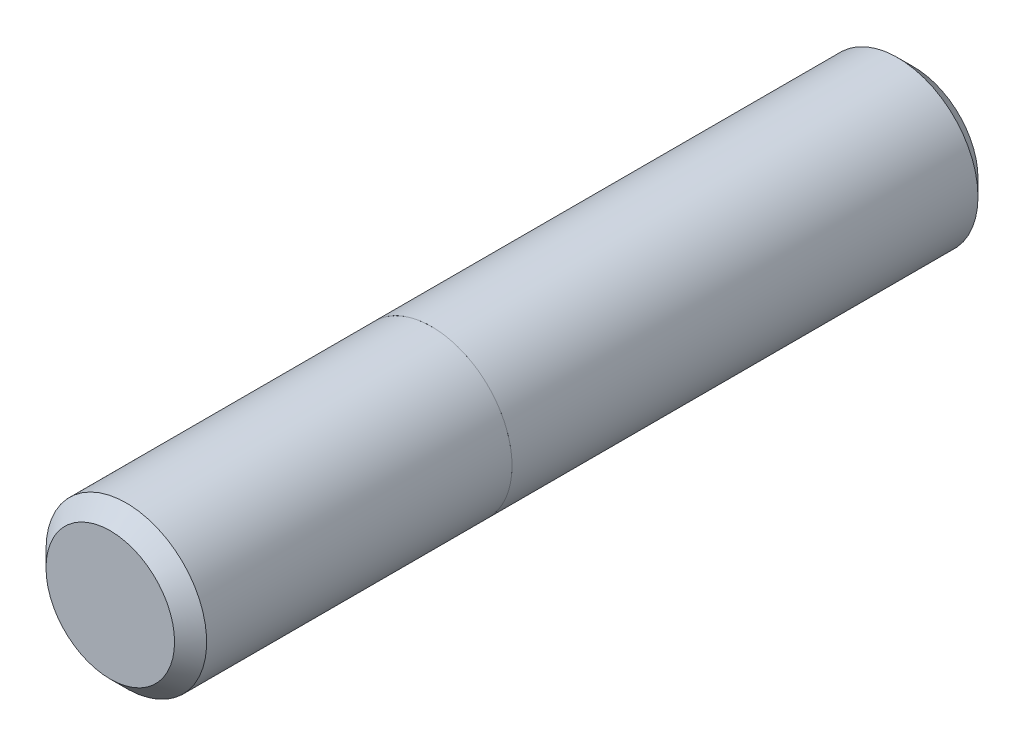
ISO-10303-21;
HEADER;
FILE_DESCRIPTION(('STEP AP214'),'2;1');
FILE_NAME('part.step','',(''),(''),'','','');
FILE_SCHEMA(('AUTOMOTIVE_DESIGN { 1 0 10303 214 1 1 1 1 }'));
ENDSEC;
DATA;
#1=APPLICATION_CONTEXT('core data for automotive mechanical design processes');
#2=APPLICATION_PROTOCOL_DEFINITION('international standard','automotive_design',2000,#1);
#3=PRODUCT_CONTEXT('',#1,'mechanical');
#4=PRODUCT('Part','Part','',(#3));
#5=PRODUCT_RELATED_PRODUCT_CATEGORY('part','',(#4));
#6=PRODUCT_DEFINITION_FORMATION('','',#4);
#7=PRODUCT_DEFINITION_CONTEXT('part definition',#1,'design');
#8=PRODUCT_DEFINITION('design','',#6,#7);
#9=PRODUCT_DEFINITION_SHAPE('','',#8);
#10=(LENGTH_UNIT() NAMED_UNIT(*) SI_UNIT(.MILLI.,.METRE.));
#11=(NAMED_UNIT(*) PLANE_ANGLE_UNIT() SI_UNIT($,.RADIAN.));
#12=(NAMED_UNIT(*) SI_UNIT($,.STERADIAN.) SOLID_ANGLE_UNIT());
#13=UNCERTAINTY_MEASURE_WITH_UNIT(LENGTH_MEASURE(1.E-05),#10,'distance_accuracy_value','');
#14=(GEOMETRIC_REPRESENTATION_CONTEXT(3) GLOBAL_UNCERTAINTY_ASSIGNED_CONTEXT((#13)) GLOBAL_UNIT_ASSIGNED_CONTEXT((#10,
#11,#12)) REPRESENTATION_CONTEXT('',''));
#15=CARTESIAN_POINT('',(0.,0.,0.));
#16=DIRECTION('',(0.,0.,1.));
#17=DIRECTION('',(1.,0.,0.));
#18=AXIS2_PLACEMENT_3D('',#15,#16,#17);
#19=CARTESIAN_POINT('',(0.,0.,50.));
#20=DIRECTION('',(0.,0.,-1.));
#21=DIRECTION('',(-1.,0.,0.));
#22=AXIS2_PLACEMENT_3D('',#19,#20,#21);
#23=CYLINDRICAL_SURFACE('',#22,5.);
#24=CARTESIAN_POINT('',(0.,0.,0.999999999999994));
#25=DIRECTION('',(0.,0.,1.));
#26=DIRECTION('',(1.,0.,0.));
#27=AXIS2_PLACEMENT_3D('',#24,#25,#26);
#28=CIRCLE('',#27,5.);
#29=CARTESIAN_POINT('',(5.,0.,0.999999999999994));
#30=VERTEX_POINT('',#29);
#31=EDGE_CURVE('E59',#30,#30,#28,.T.);
#32=ORIENTED_EDGE('',*,*,#31,.T.);
#33=EDGE_LOOP('',(#32));
#34=FACE_BOUND('',#33,.T.);
#35=CARTESIAN_POINT('',(0.,0.,30.));
#36=DIRECTION('',(0.,0.,1.));
#37=DIRECTION('',(1.,0.,0.));
#38=AXIS2_PLACEMENT_3D('',#35,#36,#37);
#39=CIRCLE('',#38,5.);
#40=CARTESIAN_POINT('',(5.,0.,30.));
#41=VERTEX_POINT('',#40);
#42=EDGE_CURVE('E50',#41,#41,#39,.T.);
#43=ORIENTED_EDGE('',*,*,#42,.F.);
#44=EDGE_LOOP('',(#43));
#45=FACE_BOUND('',#44,.T.);
#46=ADVANCED_FACE('F46',(#34,#45),#23,.T.);
#47=CARTESIAN_POINT('',(0.,0.,0.));
#48=DIRECTION('',(0.,0.,1.));
#49=DIRECTION('',(1.,0.,0.));
#50=AXIS2_PLACEMENT_3D('',#47,#48,#49);
#51=PLANE('',#50);
#52=CARTESIAN_POINT('',(0.,0.,0.));
#53=DIRECTION('',(0.,0.,1.));
#54=DIRECTION('',(1.,0.,0.));
#55=AXIS2_PLACEMENT_3D('',#52,#53,#54);
#56=CIRCLE('',#55,4.);
#57=CARTESIAN_POINT('',(4.,0.,0.));
#58=VERTEX_POINT('',#57);
#59=EDGE_CURVE('E54',#58,#58,#56,.F.);
#60=ORIENTED_EDGE('',*,*,#59,.T.);
#61=EDGE_LOOP('',(#60));
#62=FACE_BOUND('',#61,.T.);
#63=ADVANCED_FACE('F80',(#62),#51,.F.);
#64=CARTESIAN_POINT('',(0.,0.,0.999999999999994));
#65=DIRECTION('',(0.,0.,1.));
#66=DIRECTION('',(1.,0.,0.));
#67=AXIS2_PLACEMENT_3D('',#64,#65,#66);
#68=CONICAL_SURFACE('',#67,5.,0.785398163397449);
#69=ORIENTED_EDGE('',*,*,#59,.F.);
#70=EDGE_LOOP('',(#69));
#71=FACE_BOUND('',#70,.T.);
#72=ORIENTED_EDGE('',*,*,#31,.F.);
#73=EDGE_LOOP('',(#72));
#74=FACE_BOUND('',#73,.T.);
#75=ADVANCED_FACE('F77',(#71,#74),#68,.T.);
#76=CARTESIAN_POINT('',(0.,0.,30.));
#77=DIRECTION('',(0.,0.,1.));
#78=DIRECTION('',(1.,0.,0.));
#79=AXIS2_PLACEMENT_3D('',#76,#77,#78);
#80=PLANE('',#79);
#81=CARTESIAN_POINT('',(0.,0.,30.));
#82=DIRECTION('',(0.,0.,1.));
#83=DIRECTION('',(1.,0.,0.));
#84=AXIS2_PLACEMENT_3D('',#81,#82,#83);
#85=CIRCLE('',#84,4.999);
#86=CARTESIAN_POINT('',(4.999,0.,30.));
#87=VERTEX_POINT('',#86);
#88=EDGE_CURVE('E64',#87,#87,#85,.T.);
#89=ORIENTED_EDGE('',*,*,#88,.F.);
#90=EDGE_LOOP('',(#89));
#91=FACE_BOUND('',#90,.T.);
#92=ORIENTED_EDGE('',*,*,#42,.T.);
#93=EDGE_LOOP('',(#92));
#94=FACE_BOUND('',#93,.T.);
#95=ADVANCED_FACE('F79',(#91,#94),#80,.T.);
#96=CARTESIAN_POINT('',(0.,0.,50.));
#97=DIRECTION('',(0.,0.,-1.));
#98=DIRECTION('',(-1.,0.,0.));
#99=AXIS2_PLACEMENT_3D('',#96,#97,#98);
#100=CYLINDRICAL_SURFACE('',#99,4.999);
#101=CARTESIAN_POINT('',(0.,0.,49.001));
#102=DIRECTION('',(0.,0.,-1.));
#103=DIRECTION('',(-1.,0.,0.));
#104=AXIS2_PLACEMENT_3D('',#101,#102,#103);
#105=CIRCLE('',#104,4.999);
#106=CARTESIAN_POINT('',(-4.999,0.,49.001));
#107=VERTEX_POINT('',#106);
#108=EDGE_CURVE('E62',#107,#107,#105,.T.);
#109=ORIENTED_EDGE('',*,*,#108,.T.);
#110=EDGE_LOOP('',(#109));
#111=FACE_BOUND('',#110,.T.);
#112=ORIENTED_EDGE('',*,*,#88,.T.);
#113=EDGE_LOOP('',(#112));
#114=FACE_BOUND('',#113,.T.);
#115=ADVANCED_FACE('F86',(#111,#114),#100,.T.);
#116=CARTESIAN_POINT('',(0.,0.,50.));
#117=DIRECTION('',(0.,0.,1.));
#118=DIRECTION('',(1.,0.,0.));
#119=AXIS2_PLACEMENT_3D('',#116,#117,#118);
#120=PLANE('',#119);
#121=CARTESIAN_POINT('',(0.,0.,50.));
#122=DIRECTION('',(0.,0.,1.));
#123=DIRECTION('',(1.,0.,0.));
#124=AXIS2_PLACEMENT_3D('',#121,#122,#123);
#125=CIRCLE('',#124,4.00000000000001);
#126=CARTESIAN_POINT('',(4.00000000000001,0.,50.));
#127=VERTEX_POINT('',#126);
#128=EDGE_CURVE('E13',#127,#127,#125,.T.);
#129=ORIENTED_EDGE('',*,*,#128,.T.);
#130=EDGE_LOOP('',(#129));
#131=FACE_BOUND('',#130,.T.);
#132=ADVANCED_FACE('F97',(#131),#120,.T.);
#133=CARTESIAN_POINT('',(0.,0.,50.));
#134=DIRECTION('',(0.,0.,-1.));
#135=DIRECTION('',(-1.,0.,0.));
#136=AXIS2_PLACEMENT_3D('',#133,#134,#135);
#137=CONICAL_SURFACE('',#136,4.00000000000001,0.785398163397446);
#138=ORIENTED_EDGE('',*,*,#108,.F.);
#139=EDGE_LOOP('',(#138));
#140=FACE_BOUND('',#139,.T.);
#141=ORIENTED_EDGE('',*,*,#128,.F.);
#142=EDGE_LOOP('',(#141));
#143=FACE_BOUND('',#142,.T.);
#144=ADVANCED_FACE('F48',(#140,#143),#137,.T.);
#145=CLOSED_SHELL('',(#46,#63,#75,#95,#115,#132,#144));
#146=MANIFOLD_SOLID_BREP('B2',#145);
#147=ADVANCED_BREP_SHAPE_REPRESENTATION('',(#18,#146),#14);
#148=SHAPE_DEFINITION_REPRESENTATION(#9,#147);
ENDSEC;
END-ISO-10303-21;
